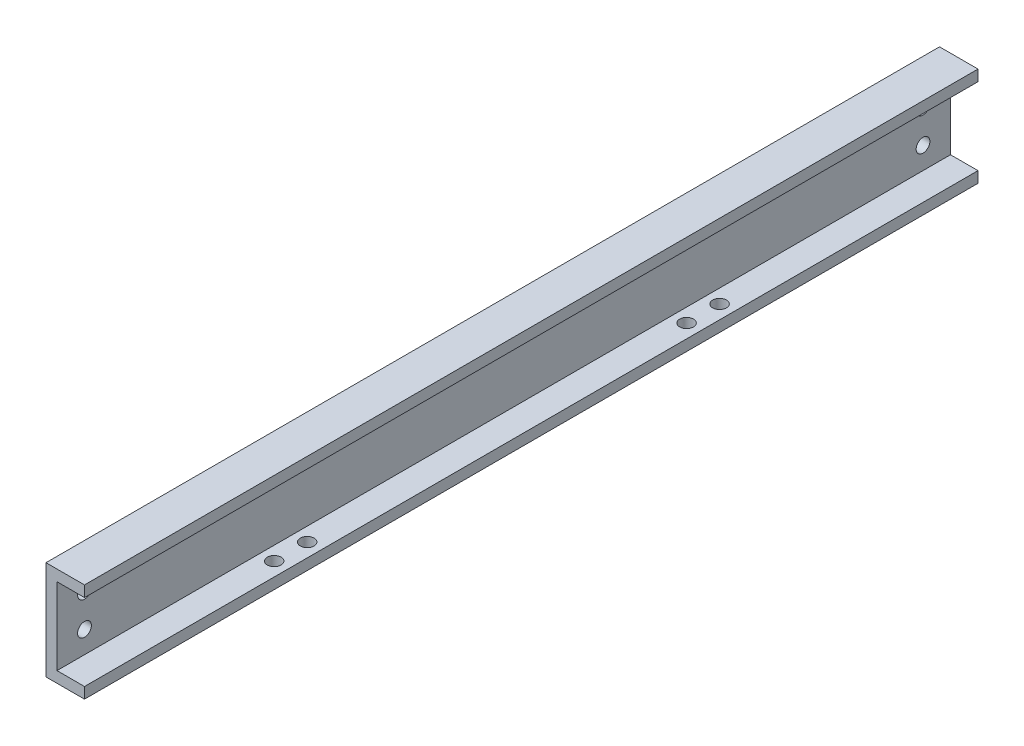
ISO-10303-21;
HEADER;
FILE_DESCRIPTION(('STEP AP214'),'2;1');
FILE_NAME('part.step','',(''),(''),'','','');
FILE_SCHEMA(('AUTOMOTIVE_DESIGN { 1 0 10303 214 1 1 1 1 }'));
ENDSEC;
DATA;
#1=APPLICATION_CONTEXT('core data for automotive mechanical design processes');
#2=APPLICATION_PROTOCOL_DEFINITION('international standard','automotive_design',2000,#1);
#3=PRODUCT_CONTEXT('',#1,'mechanical');
#4=PRODUCT('Part','Part','',(#3));
#5=PRODUCT_RELATED_PRODUCT_CATEGORY('part','',(#4));
#6=PRODUCT_DEFINITION_FORMATION('','',#4);
#7=PRODUCT_DEFINITION_CONTEXT('part definition',#1,'design');
#8=PRODUCT_DEFINITION('design','',#6,#7);
#9=PRODUCT_DEFINITION_SHAPE('','',#8);
#10=(LENGTH_UNIT() NAMED_UNIT(*) SI_UNIT(.MILLI.,.METRE.));
#11=(NAMED_UNIT(*) PLANE_ANGLE_UNIT() SI_UNIT($,.RADIAN.));
#12=(NAMED_UNIT(*) SI_UNIT($,.STERADIAN.) SOLID_ANGLE_UNIT());
#13=UNCERTAINTY_MEASURE_WITH_UNIT(LENGTH_MEASURE(1.E-05),#10,'distance_accuracy_value','');
#14=(GEOMETRIC_REPRESENTATION_CONTEXT(3) GLOBAL_UNCERTAINTY_ASSIGNED_CONTEXT((#13)) GLOBAL_UNIT_ASSIGNED_CONTEXT((#10,
#11,#12)) REPRESENTATION_CONTEXT('',''));
#15=CARTESIAN_POINT('',(0.,0.,0.));
#16=DIRECTION('',(0.,0.,1.));
#17=DIRECTION('',(1.,0.,0.));
#18=AXIS2_PLACEMENT_3D('',#15,#16,#17);
#19=CARTESIAN_POINT('',(0.,9.,-162.5));
#20=DIRECTION('',(-1.,0.,0.));
#21=DIRECTION('',(0.,-1.,0.));
#22=AXIS2_PLACEMENT_3D('',#19,#20,#21);
#23=PLANE('',#22);
#24=CARTESIAN_POINT('',(0.,2.99999999999998,-157.5));
#25=DIRECTION('',(-1.,0.,0.));
#26=DIRECTION('',(0.,1.,0.));
#27=AXIS2_PLACEMENT_3D('',#24,#25,#26);
#28=CIRCLE('',#27,1.25000000000001);
#29=CARTESIAN_POINT('',(0.,4.24999999999999,-157.5));
#30=VERTEX_POINT('',#29);
#31=EDGE_CURVE('E261',#30,#30,#28,.T.);
#32=ORIENTED_EDGE('',*,*,#31,.F.);
#33=EDGE_LOOP('',(#32));
#34=FACE_BOUND('',#33,.T.);
#35=CARTESIAN_POINT('',(0.,-3.00000000000002,-157.5));
#36=DIRECTION('',(-1.,0.,0.));
#37=DIRECTION('',(0.,-1.,0.));
#38=AXIS2_PLACEMENT_3D('',#35,#36,#37);
#39=CIRCLE('',#38,1.25000000000001);
#40=CARTESIAN_POINT('',(0.,-4.25000000000003,-157.5));
#41=VERTEX_POINT('',#40);
#42=EDGE_CURVE('E262',#41,#41,#39,.T.);
#43=ORIENTED_EDGE('',*,*,#42,.F.);
#44=EDGE_LOOP('',(#43));
#45=FACE_BOUND('',#44,.T.);
#46=CARTESIAN_POINT('',(0.,-3.,-5.));
#47=DIRECTION('',(-1.,0.,0.));
#48=DIRECTION('',(0.,1.,0.));
#49=AXIS2_PLACEMENT_3D('',#46,#47,#48);
#50=CIRCLE('',#49,1.25);
#51=CARTESIAN_POINT('',(0.,-1.75,-5.));
#52=VERTEX_POINT('',#51);
#53=EDGE_CURVE('E235',#52,#52,#50,.T.);
#54=ORIENTED_EDGE('',*,*,#53,.F.);
#55=EDGE_LOOP('',(#54));
#56=FACE_BOUND('',#55,.T.);
#57=CARTESIAN_POINT('',(0.,3.,-5.));
#58=DIRECTION('',(-1.,0.,0.));
#59=DIRECTION('',(0.,-1.,0.));
#60=AXIS2_PLACEMENT_3D('',#57,#58,#59);
#61=CIRCLE('',#60,1.25);
#62=CARTESIAN_POINT('',(0.,1.75,-5.));
#63=VERTEX_POINT('',#62);
#64=EDGE_CURVE('E231',#63,#63,#61,.T.);
#65=ORIENTED_EDGE('',*,*,#64,.F.);
#66=EDGE_LOOP('',(#65));
#67=FACE_BOUND('',#66,.T.);
#68=DIRECTION('',(0.,-1.,0.));
#69=VECTOR('',#68,1.);
#70=CARTESIAN_POINT('',(0.,9.,0.));
#71=LINE('',#70,#69);
#72=CARTESIAN_POINT('',(0.,9.,0.));
#73=VERTEX_POINT('',#72);
#74=CARTESIAN_POINT('',(0.,-9.,0.));
#75=VERTEX_POINT('',#74);
#76=EDGE_CURVE('E151',#73,#75,#71,.T.);
#77=ORIENTED_EDGE('',*,*,#76,.F.);
#78=DIRECTION('',(0.,0.,1.));
#79=VECTOR('',#78,1.);
#80=CARTESIAN_POINT('',(0.,9.,-162.5));
#81=LINE('',#80,#79);
#82=CARTESIAN_POINT('',(0.,9.,-162.5));
#83=VERTEX_POINT('',#82);
#84=EDGE_CURVE('E41',#83,#73,#81,.T.);
#85=ORIENTED_EDGE('',*,*,#84,.F.);
#86=DIRECTION('',(0.,-1.,0.));
#87=VECTOR('',#86,1.);
#88=CARTESIAN_POINT('',(0.,9.,-162.5));
#89=LINE('',#88,#87);
#90=CARTESIAN_POINT('',(0.,-9.,-162.5));
#91=VERTEX_POINT('',#90);
#92=EDGE_CURVE('E242',#83,#91,#89,.T.);
#93=ORIENTED_EDGE('',*,*,#92,.T.);
#94=DIRECTION('',(0.,0.,1.));
#95=VECTOR('',#94,1.);
#96=CARTESIAN_POINT('',(0.,-9.,-162.5));
#97=LINE('',#96,#95);
#98=EDGE_CURVE('E176',#91,#75,#97,.T.);
#99=ORIENTED_EDGE('',*,*,#98,.T.);
#100=EDGE_LOOP('',(#77,#85,#93,#99));
#101=FACE_BOUND('',#100,.T.);
#102=DIRECTION('',(0.,0.,-1.));
#103=VECTOR('',#102,1.);
#104=CARTESIAN_POINT('',(0.,1.07514622735803,-8.53208767553185));
#105=LINE('',#104,#103);
#106=CARTESIAN_POINT('',(0.,1.07514622735803,-8.53208767553185));
#107=VERTEX_POINT('',#106);
#108=CARTESIAN_POINT('',(0.,1.07514622735803,-8.84619023963443));
#109=VERTEX_POINT('',#108);
#110=EDGE_CURVE('E297',#107,#109,#105,.T.);
#111=ORIENTED_EDGE('',*,*,#110,.T.);
#112=DIRECTION('',(0.,1.,0.));
#113=VECTOR('',#112,1.);
#114=CARTESIAN_POINT('',(0.,1.07514622735803,-8.84619023963442));
#115=LINE('',#114,#113);
#116=CARTESIAN_POINT('',(0.,4.57514622735803,-8.84619023963442));
#117=VERTEX_POINT('',#116);
#118=EDGE_CURVE('E54',#109,#117,#115,.T.);
#119=ORIENTED_EDGE('',*,*,#118,.T.);
#120=DIRECTION('',(0.,0.,1.));
#121=VECTOR('',#120,1.);
#122=CARTESIAN_POINT('',(0.,4.57514622735803,-8.84619023963442));
#123=LINE('',#122,#121);
#124=CARTESIAN_POINT('',(0.,4.57514622735803,-7.14106203450621));
#125=VERTEX_POINT('',#124);
#126=EDGE_CURVE('E322',#117,#125,#123,.T.);
#127=ORIENTED_EDGE('',*,*,#126,.T.);
#128=DIRECTION('',(0.,-1.,0.));
#129=VECTOR('',#128,1.);
#130=CARTESIAN_POINT('',(0.,4.57514622735803,-7.14106203450621));
#131=LINE('',#130,#129);
#132=CARTESIAN_POINT('',(0.,4.21617186838367,-7.14106203450621));
#133=VERTEX_POINT('',#132);
#134=EDGE_CURVE('E319',#125,#133,#131,.T.);
#135=ORIENTED_EDGE('',*,*,#134,.T.);
#136=DIRECTION('',(0.,0.,-1.));
#137=VECTOR('',#136,1.);
#138=CARTESIAN_POINT('',(0.,4.21617186838367,-7.14106203450621));
#139=LINE('',#138,#137);
#140=CARTESIAN_POINT('',(0.,4.21617186838367,-8.53208767553185));
#141=VERTEX_POINT('',#140);
#142=EDGE_CURVE('E316',#133,#141,#139,.T.);
#143=ORIENTED_EDGE('',*,*,#142,.T.);
#144=DIRECTION('',(0.,-1.,0.));
#145=VECTOR('',#144,1.);
#146=CARTESIAN_POINT('',(0.,4.21617186838367,-8.53208767553185));
#147=LINE('',#146,#145);
#148=CARTESIAN_POINT('',(0.,3.13924879146059,-8.53208767553185));
#149=VERTEX_POINT('',#148);
#150=EDGE_CURVE('E313',#141,#149,#147,.T.);
#151=ORIENTED_EDGE('',*,*,#150,.T.);
#152=DIRECTION('',(0.,0.,1.));
#153=VECTOR('',#152,1.);
#154=CARTESIAN_POINT('',(0.,3.13924879146059,-8.53208767553185));
#155=LINE('',#154,#153);
#156=CARTESIAN_POINT('',(0.,3.13924879146059,-7.14106203450621));
#157=VERTEX_POINT('',#156);
#158=EDGE_CURVE('E310',#149,#157,#155,.T.);
#159=ORIENTED_EDGE('',*,*,#158,.T.);
#160=DIRECTION('',(0.,-1.,0.));
#161=VECTOR('',#160,1.);
#162=CARTESIAN_POINT('',(0.,3.13924879146059,-7.14106203450621));
#163=LINE('',#162,#161);
#164=CARTESIAN_POINT('',(0.,2.78027443248623,-7.14106203450621));
#165=VERTEX_POINT('',#164);
#166=EDGE_CURVE('E307',#157,#165,#163,.T.);
#167=ORIENTED_EDGE('',*,*,#166,.T.);
#168=DIRECTION('',(0.,0.,-1.));
#169=VECTOR('',#168,1.);
#170=CARTESIAN_POINT('',(0.,2.78027443248623,-7.14106203450621));
#171=LINE('',#170,#169);
#172=CARTESIAN_POINT('',(0.,2.78027443248623,-8.53208767553185));
#173=VERTEX_POINT('',#172);
#174=EDGE_CURVE('E304',#165,#173,#171,.T.);
#175=ORIENTED_EDGE('',*,*,#174,.T.);
#176=DIRECTION('',(0.,-1.,0.));
#177=VECTOR('',#176,1.);
#178=CARTESIAN_POINT('',(0.,2.78027443248623,-8.53208767553185));
#179=LINE('',#178,#177);
#180=EDGE_CURVE('E301',#173,#107,#179,.T.);
#181=ORIENTED_EDGE('',*,*,#180,.T.);
#182=EDGE_LOOP('',(#111,#119,#127,#135,#143,#151,#159,#167,#175,#181));
#183=FACE_BOUND('',#182,.T.);
#184=ADVANCED_FACE('F37',(#34,#45,#56,#67,#101,#183),#23,.T.);
#185=CARTESIAN_POINT('',(0.,9.,-162.5));
#186=DIRECTION('',(0.,1.,0.));
#187=DIRECTION('',(0.,0.,1.));
#188=AXIS2_PLACEMENT_3D('',#185,#186,#187);
#189=PLANE('',#188);
#190=DIRECTION('',(-1.,0.,0.));
#191=VECTOR('',#190,1.);
#192=CARTESIAN_POINT('',(0.,9.,0.));
#193=LINE('',#192,#191);
#194=CARTESIAN_POINT('',(7.,9.,0.));
#195=VERTEX_POINT('',#194);
#196=EDGE_CURVE('E148',#195,#73,#193,.T.);
#197=ORIENTED_EDGE('',*,*,#196,.F.);
#198=DIRECTION('',(0.,0.,1.));
#199=VECTOR('',#198,1.);
#200=CARTESIAN_POINT('',(7.,9.,-162.5));
#201=LINE('',#200,#199);
#202=CARTESIAN_POINT('',(7.,9.,-162.5));
#203=VERTEX_POINT('',#202);
#204=EDGE_CURVE('E11',#203,#195,#201,.T.);
#205=ORIENTED_EDGE('',*,*,#204,.F.);
#206=DIRECTION('',(-1.,0.,0.));
#207=VECTOR('',#206,1.);
#208=CARTESIAN_POINT('',(0.,9.,-162.5));
#209=LINE('',#208,#207);
#210=EDGE_CURVE('E169',#203,#83,#209,.T.);
#211=ORIENTED_EDGE('',*,*,#210,.T.);
#212=ORIENTED_EDGE('',*,*,#84,.T.);
#213=EDGE_LOOP('',(#197,#205,#211,#212));
#214=FACE_BOUND('',#213,.T.);
#215=ADVANCED_FACE('F39',(#214),#189,.T.);
#216=CARTESIAN_POINT('',(7.,9.,-162.5));
#217=DIRECTION('',(1.,0.,0.));
#218=DIRECTION('',(0.,0.,-1.));
#219=AXIS2_PLACEMENT_3D('',#216,#217,#218);
#220=PLANE('',#219);
#221=DIRECTION('',(0.,1.,0.));
#222=VECTOR('',#221,1.);
#223=CARTESIAN_POINT('',(7.,9.,0.));
#224=LINE('',#223,#222);
#225=CARTESIAN_POINT('',(7.,7.,0.));
#226=VERTEX_POINT('',#225);
#227=EDGE_CURVE('E167',#226,#195,#224,.T.);
#228=ORIENTED_EDGE('',*,*,#227,.F.);
#229=DIRECTION('',(0.,0.,1.));
#230=VECTOR('',#229,1.);
#231=CARTESIAN_POINT('',(7.,7.,-162.5));
#232=LINE('',#231,#230);
#233=CARTESIAN_POINT('',(7.,7.,-162.5));
#234=VERTEX_POINT('',#233);
#235=EDGE_CURVE('E46',#234,#226,#232,.T.);
#236=ORIENTED_EDGE('',*,*,#235,.F.);
#237=DIRECTION('',(0.,1.,0.));
#238=VECTOR('',#237,1.);
#239=CARTESIAN_POINT('',(7.,9.,-162.5));
#240=LINE('',#239,#238);
#241=EDGE_CURVE('E138',#234,#203,#240,.T.);
#242=ORIENTED_EDGE('',*,*,#241,.T.);
#243=ORIENTED_EDGE('',*,*,#204,.T.);
#244=EDGE_LOOP('',(#228,#236,#242,#243));
#245=FACE_BOUND('',#244,.T.);
#246=ADVANCED_FACE('F181',(#245),#220,.T.);
#247=CARTESIAN_POINT('',(2.,7.,-162.5));
#248=DIRECTION('',(0.,-1.,0.));
#249=DIRECTION('',(0.,0.,-1.));
#250=AXIS2_PLACEMENT_3D('',#247,#248,#249);
#251=PLANE('',#250);
#252=DIRECTION('',(1.,0.,0.));
#253=VECTOR('',#252,1.);
#254=CARTESIAN_POINT('',(2.,7.,0.));
#255=LINE('',#254,#253);
#256=CARTESIAN_POINT('',(2.,7.,0.));
#257=VERTEX_POINT('',#256);
#258=EDGE_CURVE('E125',#257,#226,#255,.T.);
#259=ORIENTED_EDGE('',*,*,#258,.F.);
#260=DIRECTION('',(0.,0.,1.));
#261=VECTOR('',#260,1.);
#262=CARTESIAN_POINT('',(2.,7.,-162.5));
#263=LINE('',#262,#261);
#264=CARTESIAN_POINT('',(2.,7.,-162.5));
#265=VERTEX_POINT('',#264);
#266=EDGE_CURVE('E119',#265,#257,#263,.T.);
#267=ORIENTED_EDGE('',*,*,#266,.F.);
#268=DIRECTION('',(1.,0.,0.));
#269=VECTOR('',#268,1.);
#270=CARTESIAN_POINT('',(2.,7.,-162.5));
#271=LINE('',#270,#269);
#272=EDGE_CURVE('E122',#265,#234,#271,.T.);
#273=ORIENTED_EDGE('',*,*,#272,.T.);
#274=ORIENTED_EDGE('',*,*,#235,.T.);
#275=EDGE_LOOP('',(#259,#267,#273,#274));
#276=FACE_BOUND('',#275,.T.);
#277=ADVANCED_FACE('F121',(#276),#251,.T.);
#278=CARTESIAN_POINT('',(2.,7.,-162.5));
#279=DIRECTION('',(1.,0.,0.));
#280=DIRECTION('',(0.,0.,-1.));
#281=AXIS2_PLACEMENT_3D('',#278,#279,#280);
#282=PLANE('',#281);
#283=CARTESIAN_POINT('',(2.,2.99999999999998,-157.5));
#284=DIRECTION('',(1.,0.,0.));
#285=DIRECTION('',(0.,0.,-1.));
#286=AXIS2_PLACEMENT_3D('',#283,#284,#285);
#287=CIRCLE('',#286,1.25000000000001);
#288=CARTESIAN_POINT('',(2.,2.99999999999998,-158.75));
#289=VERTEX_POINT('',#288);
#290=EDGE_CURVE('E152',#289,#289,#287,.T.);
#291=ORIENTED_EDGE('',*,*,#290,.F.);
#292=EDGE_LOOP('',(#291));
#293=FACE_BOUND('',#292,.T.);
#294=CARTESIAN_POINT('',(2.,-3.00000000000002,-157.5));
#295=DIRECTION('',(1.,0.,0.));
#296=DIRECTION('',(0.,0.,-1.));
#297=AXIS2_PLACEMENT_3D('',#294,#295,#296);
#298=CIRCLE('',#297,1.25000000000001);
#299=CARTESIAN_POINT('',(2.,-3.00000000000002,-158.75));
#300=VERTEX_POINT('',#299);
#301=EDGE_CURVE('E222',#300,#300,#298,.T.);
#302=ORIENTED_EDGE('',*,*,#301,.F.);
#303=EDGE_LOOP('',(#302));
#304=FACE_BOUND('',#303,.T.);
#305=CARTESIAN_POINT('',(2.,-3.,-5.));
#306=DIRECTION('',(1.,0.,0.));
#307=DIRECTION('',(0.,0.,-1.));
#308=AXIS2_PLACEMENT_3D('',#305,#306,#307);
#309=CIRCLE('',#308,1.25);
#310=CARTESIAN_POINT('',(2.,-3.,-6.25));
#311=VERTEX_POINT('',#310);
#312=EDGE_CURVE('E226',#311,#311,#309,.T.);
#313=ORIENTED_EDGE('',*,*,#312,.F.);
#314=EDGE_LOOP('',(#313));
#315=FACE_BOUND('',#314,.T.);
#316=CARTESIAN_POINT('',(2.,3.,-5.));
#317=DIRECTION('',(1.,0.,0.));
#318=DIRECTION('',(0.,0.,-1.));
#319=AXIS2_PLACEMENT_3D('',#316,#317,#318);
#320=CIRCLE('',#319,1.25);
#321=CARTESIAN_POINT('',(2.,3.,-6.25));
#322=VERTEX_POINT('',#321);
#323=EDGE_CURVE('E229',#322,#322,#320,.T.);
#324=ORIENTED_EDGE('',*,*,#323,.F.);
#325=EDGE_LOOP('',(#324));
#326=FACE_BOUND('',#325,.T.);
#327=DIRECTION('',(0.,1.,0.));
#328=VECTOR('',#327,1.);
#329=CARTESIAN_POINT('',(2.,7.,0.));
#330=LINE('',#329,#328);
#331=CARTESIAN_POINT('',(2.,-7.,0.));
#332=VERTEX_POINT('',#331);
#333=EDGE_CURVE('E164',#332,#257,#330,.T.);
#334=ORIENTED_EDGE('',*,*,#333,.F.);
#335=DIRECTION('',(0.,0.,1.));
#336=VECTOR('',#335,1.);
#337=CARTESIAN_POINT('',(2.,-7.,-162.5));
#338=LINE('',#337,#336);
#339=CARTESIAN_POINT('',(2.,-7.,-162.5));
#340=VERTEX_POINT('',#339);
#341=EDGE_CURVE('E130',#340,#332,#338,.T.);
#342=ORIENTED_EDGE('',*,*,#341,.F.);
#343=DIRECTION('',(0.,1.,0.));
#344=VECTOR('',#343,1.);
#345=CARTESIAN_POINT('',(2.,7.,-162.5));
#346=LINE('',#345,#344);
#347=EDGE_CURVE('E136',#340,#265,#346,.T.);
#348=ORIENTED_EDGE('',*,*,#347,.T.);
#349=ORIENTED_EDGE('',*,*,#266,.T.);
#350=EDGE_LOOP('',(#334,#342,#348,#349));
#351=FACE_BOUND('',#350,.T.);
#352=ADVANCED_FACE('F140',(#293,#304,#315,#326,#351),#282,.T.);
#353=CARTESIAN_POINT('',(2.,-7.,-162.5));
#354=DIRECTION('',(0.,1.,0.));
#355=DIRECTION('',(-1.,0.,0.));
#356=AXIS2_PLACEMENT_3D('',#353,#354,#355);
#357=PLANE('',#356);
#358=CARTESIAN_POINT('',(4.50000000000001,-7.,-37.));
#359=DIRECTION('',(0.,1.,0.));
#360=DIRECTION('',(-1.,0.,0.));
#361=AXIS2_PLACEMENT_3D('',#358,#359,#360);
#362=CIRCLE('',#361,1.25);
#363=CARTESIAN_POINT('',(3.25000000000001,-7.,-37.));
#364=VERTEX_POINT('',#363);
#365=EDGE_CURVE('E326',#364,#364,#362,.T.);
#366=ORIENTED_EDGE('',*,*,#365,.F.);
#367=EDGE_LOOP('',(#366));
#368=FACE_BOUND('',#367,.T.);
#369=CARTESIAN_POINT('',(4.5,-7.,-43.));
#370=DIRECTION('',(0.,1.,0.));
#371=DIRECTION('',(-1.,0.,0.));
#372=AXIS2_PLACEMENT_3D('',#369,#370,#371);
#373=CIRCLE('',#372,1.25);
#374=CARTESIAN_POINT('',(3.25,-7.,-43.));
#375=VERTEX_POINT('',#374);
#376=EDGE_CURVE('E357',#375,#375,#373,.T.);
#377=ORIENTED_EDGE('',*,*,#376,.F.);
#378=EDGE_LOOP('',(#377));
#379=FACE_BOUND('',#378,.T.);
#380=CARTESIAN_POINT('',(4.50000000000002,-7.,-112.));
#381=DIRECTION('',(0.,1.,0.));
#382=DIRECTION('',(-1.,0.,0.));
#383=AXIS2_PLACEMENT_3D('',#380,#381,#382);
#384=CIRCLE('',#383,1.25);
#385=CARTESIAN_POINT('',(3.25000000000002,-7.,-112.));
#386=VERTEX_POINT('',#385);
#387=EDGE_CURVE('E360',#386,#386,#384,.T.);
#388=ORIENTED_EDGE('',*,*,#387,.F.);
#389=EDGE_LOOP('',(#388));
#390=FACE_BOUND('',#389,.T.);
#391=CARTESIAN_POINT('',(4.50000000000002,-7.,-118.));
#392=DIRECTION('',(0.,1.,0.));
#393=DIRECTION('',(-1.,0.,0.));
#394=AXIS2_PLACEMENT_3D('',#391,#392,#393);
#395=CIRCLE('',#394,1.25);
#396=CARTESIAN_POINT('',(3.25000000000002,-7.,-118.));
#397=VERTEX_POINT('',#396);
#398=EDGE_CURVE('E363',#397,#397,#395,.T.);
#399=ORIENTED_EDGE('',*,*,#398,.F.);
#400=EDGE_LOOP('',(#399));
#401=FACE_BOUND('',#400,.T.);
#402=DIRECTION('',(-1.,0.,0.));
#403=VECTOR('',#402,1.);
#404=CARTESIAN_POINT('',(2.,-7.,0.));
#405=LINE('',#404,#403);
#406=CARTESIAN_POINT('',(7.,-7.,0.));
#407=VERTEX_POINT('',#406);
#408=EDGE_CURVE('E161',#407,#332,#405,.T.);
#409=ORIENTED_EDGE('',*,*,#408,.F.);
#410=DIRECTION('',(0.,0.,1.));
#411=VECTOR('',#410,1.);
#412=CARTESIAN_POINT('',(7.,-7.,-162.5));
#413=LINE('',#412,#411);
#414=CARTESIAN_POINT('',(7.,-7.,-162.5));
#415=VERTEX_POINT('',#414);
#416=EDGE_CURVE('E173',#415,#407,#413,.T.);
#417=ORIENTED_EDGE('',*,*,#416,.F.);
#418=DIRECTION('',(-1.,0.,0.));
#419=VECTOR('',#418,1.);
#420=CARTESIAN_POINT('',(2.,-7.,-162.5));
#421=LINE('',#420,#419);
#422=EDGE_CURVE('E141',#415,#340,#421,.T.);
#423=ORIENTED_EDGE('',*,*,#422,.T.);
#424=ORIENTED_EDGE('',*,*,#341,.T.);
#425=EDGE_LOOP('',(#409,#417,#423,#424));
#426=FACE_BOUND('',#425,.T.);
#427=ADVANCED_FACE('F206',(#368,#379,#390,#401,#426),#357,.T.);
#428=CARTESIAN_POINT('',(7.,-9.,-162.5));
#429=DIRECTION('',(1.,0.,0.));
#430=DIRECTION('',(0.,0.,-1.));
#431=AXIS2_PLACEMENT_3D('',#428,#429,#430);
#432=PLANE('',#431);
#433=DIRECTION('',(0.,1.,0.));
#434=VECTOR('',#433,1.);
#435=CARTESIAN_POINT('',(7.,-9.,0.));
#436=LINE('',#435,#434);
#437=CARTESIAN_POINT('',(7.,-9.,0.));
#438=VERTEX_POINT('',#437);
#439=EDGE_CURVE('E158',#438,#407,#436,.T.);
#440=ORIENTED_EDGE('',*,*,#439,.F.);
#441=DIRECTION('',(0.,0.,1.));
#442=VECTOR('',#441,1.);
#443=CARTESIAN_POINT('',(7.,-9.,-162.5));
#444=LINE('',#443,#442);
#445=CARTESIAN_POINT('',(7.,-9.,-162.5));
#446=VERTEX_POINT('',#445);
#447=EDGE_CURVE('E175',#446,#438,#444,.T.);
#448=ORIENTED_EDGE('',*,*,#447,.F.);
#449=DIRECTION('',(0.,1.,0.));
#450=VECTOR('',#449,1.);
#451=CARTESIAN_POINT('',(7.,-9.,-162.5));
#452=LINE('',#451,#450);
#453=EDGE_CURVE('E143',#446,#415,#452,.T.);
#454=ORIENTED_EDGE('',*,*,#453,.T.);
#455=ORIENTED_EDGE('',*,*,#416,.T.);
#456=EDGE_LOOP('',(#440,#448,#454,#455));
#457=FACE_BOUND('',#456,.T.);
#458=ADVANCED_FACE('F202',(#457),#432,.T.);
#459=CARTESIAN_POINT('',(0.,-9.,-162.5));
#460=DIRECTION('',(0.,-1.,0.));
#461=DIRECTION('',(0.,0.,-1.));
#462=AXIS2_PLACEMENT_3D('',#459,#460,#461);
#463=PLANE('',#462);
#464=CARTESIAN_POINT('',(4.50000000000001,-9.,-37.));
#465=DIRECTION('',(0.,-1.,0.));
#466=DIRECTION('',(0.,0.,-1.));
#467=AXIS2_PLACEMENT_3D('',#464,#465,#466);
#468=CIRCLE('',#467,1.25);
#469=CARTESIAN_POINT('',(4.50000000000001,-9.,-38.25));
#470=VERTEX_POINT('',#469);
#471=EDGE_CURVE('E366',#470,#470,#468,.T.);
#472=ORIENTED_EDGE('',*,*,#471,.F.);
#473=EDGE_LOOP('',(#472));
#474=FACE_BOUND('',#473,.T.);
#475=CARTESIAN_POINT('',(4.5,-9.,-43.));
#476=DIRECTION('',(0.,-1.,0.));
#477=DIRECTION('',(0.,0.,1.));
#478=AXIS2_PLACEMENT_3D('',#475,#476,#477);
#479=CIRCLE('',#478,1.25);
#480=CARTESIAN_POINT('',(4.5,-9.,-41.75));
#481=VERTEX_POINT('',#480);
#482=EDGE_CURVE('E373',#481,#481,#479,.T.);
#483=ORIENTED_EDGE('',*,*,#482,.F.);
#484=EDGE_LOOP('',(#483));
#485=FACE_BOUND('',#484,.T.);
#486=CARTESIAN_POINT('',(4.50000000000002,-9.,-112.));
#487=DIRECTION('',(0.,-1.,0.));
#488=DIRECTION('',(0.,0.,-1.));
#489=AXIS2_PLACEMENT_3D('',#486,#487,#488);
#490=CIRCLE('',#489,1.25);
#491=CARTESIAN_POINT('',(4.50000000000002,-9.,-113.25));
#492=VERTEX_POINT('',#491);
#493=EDGE_CURVE('E370',#492,#492,#490,.T.);
#494=ORIENTED_EDGE('',*,*,#493,.F.);
#495=EDGE_LOOP('',(#494));
#496=FACE_BOUND('',#495,.T.);
#497=CARTESIAN_POINT('',(4.50000000000002,-9.,-118.));
#498=DIRECTION('',(0.,-1.,0.));
#499=DIRECTION('',(0.,0.,1.));
#500=AXIS2_PLACEMENT_3D('',#497,#498,#499);
#501=CIRCLE('',#500,1.25);
#502=CARTESIAN_POINT('',(4.50000000000002,-9.,-116.75));
#503=VERTEX_POINT('',#502);
#504=EDGE_CURVE('E367',#503,#503,#501,.T.);
#505=ORIENTED_EDGE('',*,*,#504,.F.);
#506=EDGE_LOOP('',(#505));
#507=FACE_BOUND('',#506,.T.);
#508=DIRECTION('',(1.,0.,0.));
#509=VECTOR('',#508,1.);
#510=CARTESIAN_POINT('',(0.,-9.,0.));
#511=LINE('',#510,#509);
#512=EDGE_CURVE('E155',#75,#438,#511,.T.);
#513=ORIENTED_EDGE('',*,*,#512,.F.);
#514=ORIENTED_EDGE('',*,*,#98,.F.);
#515=DIRECTION('',(1.,0.,0.));
#516=VECTOR('',#515,1.);
#517=CARTESIAN_POINT('',(0.,-9.,-162.5));
#518=LINE('',#517,#516);
#519=EDGE_CURVE('E244',#91,#446,#518,.T.);
#520=ORIENTED_EDGE('',*,*,#519,.T.);
#521=ORIENTED_EDGE('',*,*,#447,.T.);
#522=EDGE_LOOP('',(#513,#514,#520,#521));
#523=FACE_BOUND('',#522,.T.);
#524=ADVANCED_FACE('F199',(#474,#485,#496,#507,#523),#463,.T.);
#525=CARTESIAN_POINT('',(0.,0.,-162.5));
#526=DIRECTION('',(0.,0.,-1.));
#527=DIRECTION('',(-1.,0.,0.));
#528=AXIS2_PLACEMENT_3D('',#525,#526,#527);
#529=PLANE('',#528);
#530=ORIENTED_EDGE('',*,*,#210,.F.);
#531=ORIENTED_EDGE('',*,*,#241,.F.);
#532=ORIENTED_EDGE('',*,*,#272,.F.);
#533=ORIENTED_EDGE('',*,*,#347,.F.);
#534=ORIENTED_EDGE('',*,*,#422,.F.);
#535=ORIENTED_EDGE('',*,*,#453,.F.);
#536=ORIENTED_EDGE('',*,*,#519,.F.);
#537=ORIENTED_EDGE('',*,*,#92,.F.);
#538=EDGE_LOOP('',(#530,#531,#532,#533,#534,#535,#536,#537));
#539=FACE_BOUND('',#538,.T.);
#540=ADVANCED_FACE('F134',(#539),#529,.T.);
#541=CARTESIAN_POINT('',(0.,0.,0.));
#542=DIRECTION('',(0.,0.,-1.));
#543=DIRECTION('',(-1.,0.,0.));
#544=AXIS2_PLACEMENT_3D('',#541,#542,#543);
#545=PLANE('',#544);
#546=ORIENTED_EDGE('',*,*,#196,.T.);
#547=ORIENTED_EDGE('',*,*,#76,.T.);
#548=ORIENTED_EDGE('',*,*,#512,.T.);
#549=ORIENTED_EDGE('',*,*,#439,.T.);
#550=ORIENTED_EDGE('',*,*,#408,.T.);
#551=ORIENTED_EDGE('',*,*,#333,.T.);
#552=ORIENTED_EDGE('',*,*,#258,.T.);
#553=ORIENTED_EDGE('',*,*,#227,.T.);
#554=EDGE_LOOP('',(#546,#547,#548,#549,#550,#551,#552,#553));
#555=FACE_BOUND('',#554,.T.);
#556=ADVANCED_FACE('F180',(#555),#545,.F.);
#557=CARTESIAN_POINT('',(7.,3.,-5.));
#558=DIRECTION('',(-1.,0.,0.));
#559=DIRECTION('',(0.,-1.,0.));
#560=AXIS2_PLACEMENT_3D('',#557,#558,#559);
#561=CYLINDRICAL_SURFACE('',#560,1.25);
#562=ORIENTED_EDGE('',*,*,#323,.T.);
#563=EDGE_LOOP('',(#562));
#564=FACE_BOUND('',#563,.T.);
#565=ORIENTED_EDGE('',*,*,#64,.T.);
#566=EDGE_LOOP('',(#565));
#567=FACE_BOUND('',#566,.T.);
#568=ADVANCED_FACE('F445',(#564,#567),#561,.F.);
#569=CARTESIAN_POINT('',(7.,-3.,-5.));
#570=DIRECTION('',(-1.,0.,0.));
#571=DIRECTION('',(0.,-1.,0.));
#572=AXIS2_PLACEMENT_3D('',#569,#570,#571);
#573=CYLINDRICAL_SURFACE('',#572,1.25);
#574=ORIENTED_EDGE('',*,*,#312,.T.);
#575=EDGE_LOOP('',(#574));
#576=FACE_BOUND('',#575,.T.);
#577=ORIENTED_EDGE('',*,*,#53,.T.);
#578=EDGE_LOOP('',(#577));
#579=FACE_BOUND('',#578,.T.);
#580=ADVANCED_FACE('F442',(#576,#579),#573,.F.);
#581=CARTESIAN_POINT('',(7.,-3.00000000000002,-157.5));
#582=DIRECTION('',(-1.,0.,0.));
#583=DIRECTION('',(0.,-1.,0.));
#584=AXIS2_PLACEMENT_3D('',#581,#582,#583);
#585=CYLINDRICAL_SURFACE('',#584,1.25000000000001);
#586=ORIENTED_EDGE('',*,*,#301,.T.);
#587=EDGE_LOOP('',(#586));
#588=FACE_BOUND('',#587,.T.);
#589=ORIENTED_EDGE('',*,*,#42,.T.);
#590=EDGE_LOOP('',(#589));
#591=FACE_BOUND('',#590,.T.);
#592=ADVANCED_FACE('F258',(#588,#591),#585,.F.);
#593=CARTESIAN_POINT('',(7.,2.99999999999998,-157.5));
#594=DIRECTION('',(-1.,0.,0.));
#595=DIRECTION('',(0.,-1.,0.));
#596=AXIS2_PLACEMENT_3D('',#593,#594,#595);
#597=CYLINDRICAL_SURFACE('',#596,1.25000000000001);
#598=ORIENTED_EDGE('',*,*,#290,.T.);
#599=EDGE_LOOP('',(#598));
#600=FACE_BOUND('',#599,.T.);
#601=ORIENTED_EDGE('',*,*,#31,.T.);
#602=EDGE_LOOP('',(#601));
#603=FACE_BOUND('',#602,.T.);
#604=ADVANCED_FACE('F254',(#600,#603),#597,.F.);
#605=CARTESIAN_POINT('',(1.,1.07514622735803,-8.84619023963442));
#606=DIRECTION('',(0.,0.,1.));
#607=DIRECTION('',(1.,0.,0.));
#608=AXIS2_PLACEMENT_3D('',#605,#606,#607);
#609=PLANE('',#608);
#610=ORIENTED_EDGE('',*,*,#118,.F.);
#611=DIRECTION('',(-1.,0.,0.));
#612=VECTOR('',#611,1.);
#613=CARTESIAN_POINT('',(1.,1.07514622735803,-8.84619023963442));
#614=LINE('',#613,#612);
#615=CARTESIAN_POINT('',(1.,1.07514622735803,-8.84619023963442));
#616=VERTEX_POINT('',#615);
#617=EDGE_CURVE('E294',#616,#109,#614,.T.);
#618=ORIENTED_EDGE('',*,*,#617,.F.);
#619=DIRECTION('',(0.,1.,0.));
#620=VECTOR('',#619,1.);
#621=CARTESIAN_POINT('',(1.,1.07514622735803,-8.84619023963442));
#622=LINE('',#621,#620);
#623=CARTESIAN_POINT('',(0.999999999999999,4.57514622735803,-8.84619023963442));
#624=VERTEX_POINT('',#623);
#625=EDGE_CURVE('E300',#616,#624,#622,.T.);
#626=ORIENTED_EDGE('',*,*,#625,.T.);
#627=DIRECTION('',(-1.,0.,0.));
#628=VECTOR('',#627,1.);
#629=CARTESIAN_POINT('',(0.999999999999999,4.57514622735803,-8.84619023963442));
#630=LINE('',#629,#628);
#631=EDGE_CURVE('E263',#624,#117,#630,.T.);
#632=ORIENTED_EDGE('',*,*,#631,.T.);
#633=EDGE_LOOP('',(#610,#618,#626,#632));
#634=FACE_BOUND('',#633,.T.);
#635=ADVANCED_FACE('F257',(#634),#609,.T.);
#636=CARTESIAN_POINT('',(0.999999999999999,4.57514622735803,-8.84619023963442));
#637=DIRECTION('',(0.,-1.,0.));
#638=DIRECTION('',(1.,0.,0.));
#639=AXIS2_PLACEMENT_3D('',#636,#637,#638);
#640=PLANE('',#639);
#641=ORIENTED_EDGE('',*,*,#126,.F.);
#642=ORIENTED_EDGE('',*,*,#631,.F.);
#643=DIRECTION('',(0.,0.,1.));
#644=VECTOR('',#643,1.);
#645=CARTESIAN_POINT('',(0.999999999999999,4.57514622735803,-8.84619023963442));
#646=LINE('',#645,#644);
#647=CARTESIAN_POINT('',(0.999999999999999,4.57514622735803,-7.14106203450621));
#648=VERTEX_POINT('',#647);
#649=EDGE_CURVE('E350',#624,#648,#646,.T.);
#650=ORIENTED_EDGE('',*,*,#649,.T.);
#651=DIRECTION('',(-1.,0.,0.));
#652=VECTOR('',#651,1.);
#653=CARTESIAN_POINT('',(0.999999999999999,4.57514622735803,-7.14106203450621));
#654=LINE('',#653,#652);
#655=EDGE_CURVE('E266',#648,#125,#654,.T.);
#656=ORIENTED_EDGE('',*,*,#655,.T.);
#657=EDGE_LOOP('',(#641,#642,#650,#656));
#658=FACE_BOUND('',#657,.T.);
#659=ADVANCED_FACE('F435',(#658),#640,.T.);
#660=CARTESIAN_POINT('',(0.999999999999999,4.57514622735803,-7.14106203450621));
#661=DIRECTION('',(0.,0.,-1.));
#662=DIRECTION('',(-1.,0.,0.));
#663=AXIS2_PLACEMENT_3D('',#660,#661,#662);
#664=PLANE('',#663);
#665=ORIENTED_EDGE('',*,*,#134,.F.);
#666=ORIENTED_EDGE('',*,*,#655,.F.);
#667=DIRECTION('',(0.,-1.,0.));
#668=VECTOR('',#667,1.);
#669=CARTESIAN_POINT('',(0.999999999999999,4.57514622735803,-7.14106203450621));
#670=LINE('',#669,#668);
#671=CARTESIAN_POINT('',(1.,4.21617186838367,-7.14106203450621));
#672=VERTEX_POINT('',#671);
#673=EDGE_CURVE('E347',#648,#672,#670,.T.);
#674=ORIENTED_EDGE('',*,*,#673,.T.);
#675=DIRECTION('',(-1.,0.,0.));
#676=VECTOR('',#675,1.);
#677=CARTESIAN_POINT('',(1.,4.21617186838367,-7.14106203450621));
#678=LINE('',#677,#676);
#679=EDGE_CURVE('E273',#672,#133,#678,.T.);
#680=ORIENTED_EDGE('',*,*,#679,.T.);
#681=EDGE_LOOP('',(#665,#666,#674,#680));
#682=FACE_BOUND('',#681,.T.);
#683=ADVANCED_FACE('F431',(#682),#664,.T.);
#684=CARTESIAN_POINT('',(1.,4.21617186838367,-7.14106203450621));
#685=DIRECTION('',(0.,1.,0.));
#686=DIRECTION('',(-1.,0.,0.));
#687=AXIS2_PLACEMENT_3D('',#684,#685,#686);
#688=PLANE('',#687);
#689=ORIENTED_EDGE('',*,*,#142,.F.);
#690=ORIENTED_EDGE('',*,*,#679,.F.);
#691=DIRECTION('',(0.,0.,-1.));
#692=VECTOR('',#691,1.);
#693=CARTESIAN_POINT('',(1.,4.21617186838367,-7.14106203450621));
#694=LINE('',#693,#692);
#695=CARTESIAN_POINT('',(1.,4.21617186838367,-8.53208767553185));
#696=VERTEX_POINT('',#695);
#697=EDGE_CURVE('E344',#672,#696,#694,.T.);
#698=ORIENTED_EDGE('',*,*,#697,.T.);
#699=DIRECTION('',(-1.,0.,0.));
#700=VECTOR('',#699,1.);
#701=CARTESIAN_POINT('',(1.,4.21617186838367,-8.53208767553185));
#702=LINE('',#701,#700);
#703=EDGE_CURVE('E276',#696,#141,#702,.T.);
#704=ORIENTED_EDGE('',*,*,#703,.T.);
#705=EDGE_LOOP('',(#689,#690,#698,#704));
#706=FACE_BOUND('',#705,.T.);
#707=ADVANCED_FACE('F427',(#706),#688,.T.);
#708=CARTESIAN_POINT('',(1.,4.21617186838367,-8.53208767553185));
#709=DIRECTION('',(0.,0.,-1.));
#710=DIRECTION('',(-1.,0.,0.));
#711=AXIS2_PLACEMENT_3D('',#708,#709,#710);
#712=PLANE('',#711);
#713=ORIENTED_EDGE('',*,*,#150,.F.);
#714=ORIENTED_EDGE('',*,*,#703,.F.);
#715=DIRECTION('',(0.,-1.,0.));
#716=VECTOR('',#715,1.);
#717=CARTESIAN_POINT('',(1.,4.21617186838367,-8.53208767553185));
#718=LINE('',#717,#716);
#719=CARTESIAN_POINT('',(1.,3.13924879146059,-8.53208767553185));
#720=VERTEX_POINT('',#719);
#721=EDGE_CURVE('E341',#696,#720,#718,.T.);
#722=ORIENTED_EDGE('',*,*,#721,.T.);
#723=DIRECTION('',(-1.,0.,0.));
#724=VECTOR('',#723,1.);
#725=CARTESIAN_POINT('',(1.,3.13924879146059,-8.53208767553185));
#726=LINE('',#725,#724);
#727=EDGE_CURVE('E279',#720,#149,#726,.T.);
#728=ORIENTED_EDGE('',*,*,#727,.T.);
#729=EDGE_LOOP('',(#713,#714,#722,#728));
#730=FACE_BOUND('',#729,.T.);
#731=ADVANCED_FACE('F423',(#730),#712,.T.);
#732=CARTESIAN_POINT('',(1.,3.13924879146059,-8.53208767553185));
#733=DIRECTION('',(0.,-1.,0.));
#734=DIRECTION('',(1.,0.,0.));
#735=AXIS2_PLACEMENT_3D('',#732,#733,#734);
#736=PLANE('',#735);
#737=ORIENTED_EDGE('',*,*,#158,.F.);
#738=ORIENTED_EDGE('',*,*,#727,.F.);
#739=DIRECTION('',(0.,0.,1.));
#740=VECTOR('',#739,1.);
#741=CARTESIAN_POINT('',(1.,3.13924879146059,-8.53208767553185));
#742=LINE('',#741,#740);
#743=CARTESIAN_POINT('',(1.,3.13924879146059,-7.14106203450621));
#744=VERTEX_POINT('',#743);
#745=EDGE_CURVE('E338',#720,#744,#742,.T.);
#746=ORIENTED_EDGE('',*,*,#745,.T.);
#747=DIRECTION('',(-1.,0.,0.));
#748=VECTOR('',#747,1.);
#749=CARTESIAN_POINT('',(1.,3.13924879146059,-7.14106203450621));
#750=LINE('',#749,#748);
#751=EDGE_CURVE('E282',#744,#157,#750,.T.);
#752=ORIENTED_EDGE('',*,*,#751,.T.);
#753=EDGE_LOOP('',(#737,#738,#746,#752));
#754=FACE_BOUND('',#753,.T.);
#755=ADVANCED_FACE('F419',(#754),#736,.T.);
#756=CARTESIAN_POINT('',(1.,3.13924879146059,-7.14106203450621));
#757=DIRECTION('',(0.,0.,-1.));
#758=DIRECTION('',(-1.,0.,0.));
#759=AXIS2_PLACEMENT_3D('',#756,#757,#758);
#760=PLANE('',#759);
#761=ORIENTED_EDGE('',*,*,#166,.F.);
#762=ORIENTED_EDGE('',*,*,#751,.F.);
#763=DIRECTION('',(0.,-1.,0.));
#764=VECTOR('',#763,1.);
#765=CARTESIAN_POINT('',(1.,3.13924879146059,-7.14106203450621));
#766=LINE('',#765,#764);
#767=CARTESIAN_POINT('',(1.,2.78027443248623,-7.14106203450621));
#768=VERTEX_POINT('',#767);
#769=EDGE_CURVE('E335',#744,#768,#766,.T.);
#770=ORIENTED_EDGE('',*,*,#769,.T.);
#771=DIRECTION('',(-1.,0.,0.));
#772=VECTOR('',#771,1.);
#773=CARTESIAN_POINT('',(1.,2.78027443248623,-7.14106203450621));
#774=LINE('',#773,#772);
#775=EDGE_CURVE('E285',#768,#165,#774,.T.);
#776=ORIENTED_EDGE('',*,*,#775,.T.);
#777=EDGE_LOOP('',(#761,#762,#770,#776));
#778=FACE_BOUND('',#777,.T.);
#779=ADVANCED_FACE('F415',(#778),#760,.T.);
#780=CARTESIAN_POINT('',(1.,2.78027443248623,-7.14106203450621));
#781=DIRECTION('',(0.,1.,0.));
#782=DIRECTION('',(-1.,0.,0.));
#783=AXIS2_PLACEMENT_3D('',#780,#781,#782);
#784=PLANE('',#783);
#785=ORIENTED_EDGE('',*,*,#174,.F.);
#786=ORIENTED_EDGE('',*,*,#775,.F.);
#787=DIRECTION('',(0.,0.,-1.));
#788=VECTOR('',#787,1.);
#789=CARTESIAN_POINT('',(1.,2.78027443248623,-7.14106203450621));
#790=LINE('',#789,#788);
#791=CARTESIAN_POINT('',(1.,2.78027443248623,-8.53208767553185));
#792=VERTEX_POINT('',#791);
#793=EDGE_CURVE('E332',#768,#792,#790,.T.);
#794=ORIENTED_EDGE('',*,*,#793,.T.);
#795=DIRECTION('',(-1.,0.,0.));
#796=VECTOR('',#795,1.);
#797=CARTESIAN_POINT('',(1.,2.78027443248623,-8.53208767553185));
#798=LINE('',#797,#796);
#799=EDGE_CURVE('E288',#792,#173,#798,.T.);
#800=ORIENTED_EDGE('',*,*,#799,.T.);
#801=EDGE_LOOP('',(#785,#786,#794,#800));
#802=FACE_BOUND('',#801,.T.);
#803=ADVANCED_FACE('F411',(#802),#784,.T.);
#804=CARTESIAN_POINT('',(1.,2.78027443248623,-8.53208767553185));
#805=DIRECTION('',(0.,0.,-1.));
#806=DIRECTION('',(-1.,0.,0.));
#807=AXIS2_PLACEMENT_3D('',#804,#805,#806);
#808=PLANE('',#807);
#809=ORIENTED_EDGE('',*,*,#180,.F.);
#810=ORIENTED_EDGE('',*,*,#799,.F.);
#811=DIRECTION('',(0.,-1.,0.));
#812=VECTOR('',#811,1.);
#813=CARTESIAN_POINT('',(1.,2.78027443248623,-8.53208767553185));
#814=LINE('',#813,#812);
#815=CARTESIAN_POINT('',(1.,1.07514622735803,-8.53208767553185));
#816=VERTEX_POINT('',#815);
#817=EDGE_CURVE('E329',#792,#816,#814,.T.);
#818=ORIENTED_EDGE('',*,*,#817,.T.);
#819=DIRECTION('',(-1.,0.,0.));
#820=VECTOR('',#819,1.);
#821=CARTESIAN_POINT('',(1.,1.07514622735803,-8.53208767553185));
#822=LINE('',#821,#820);
#823=EDGE_CURVE('E291',#816,#107,#822,.T.);
#824=ORIENTED_EDGE('',*,*,#823,.T.);
#825=EDGE_LOOP('',(#809,#810,#818,#824));
#826=FACE_BOUND('',#825,.T.);
#827=ADVANCED_FACE('F407',(#826),#808,.T.);
#828=CARTESIAN_POINT('',(1.,1.07514622735803,-8.53208767553185));
#829=DIRECTION('',(0.,1.,0.));
#830=DIRECTION('',(-1.,0.,0.));
#831=AXIS2_PLACEMENT_3D('',#828,#829,#830);
#832=PLANE('',#831);
#833=ORIENTED_EDGE('',*,*,#110,.F.);
#834=ORIENTED_EDGE('',*,*,#823,.F.);
#835=DIRECTION('',(0.,0.,-1.));
#836=VECTOR('',#835,1.);
#837=CARTESIAN_POINT('',(1.,1.07514622735803,-8.53208767553185));
#838=LINE('',#837,#836);
#839=EDGE_CURVE('E296',#816,#616,#838,.T.);
#840=ORIENTED_EDGE('',*,*,#839,.T.);
#841=ORIENTED_EDGE('',*,*,#617,.T.);
#842=EDGE_LOOP('',(#833,#834,#840,#841));
#843=FACE_BOUND('',#842,.T.);
#844=ADVANCED_FACE('F400',(#843),#832,.T.);
#845=CARTESIAN_POINT('',(1.,0.,0.));
#846=DIRECTION('',(1.,0.,0.));
#847=DIRECTION('',(0.,1.,0.));
#848=AXIS2_PLACEMENT_3D('',#845,#846,#847);
#849=PLANE('',#848);
#850=ORIENTED_EDGE('',*,*,#625,.F.);
#851=ORIENTED_EDGE('',*,*,#839,.F.);
#852=ORIENTED_EDGE('',*,*,#817,.F.);
#853=ORIENTED_EDGE('',*,*,#793,.F.);
#854=ORIENTED_EDGE('',*,*,#769,.F.);
#855=ORIENTED_EDGE('',*,*,#745,.F.);
#856=ORIENTED_EDGE('',*,*,#721,.F.);
#857=ORIENTED_EDGE('',*,*,#697,.F.);
#858=ORIENTED_EDGE('',*,*,#673,.F.);
#859=ORIENTED_EDGE('',*,*,#649,.F.);
#860=EDGE_LOOP('',(#850,#851,#852,#853,#854,#855,#856,#857,#858,#859));
#861=FACE_BOUND('',#860,.T.);
#862=ADVANCED_FACE('F390',(#861),#849,.F.);
#863=CARTESIAN_POINT('',(4.50000000000002,-6.,-118.));
#864=DIRECTION('',(0.,-1.,0.));
#865=DIRECTION('',(0.,0.,-1.));
#866=AXIS2_PLACEMENT_3D('',#863,#864,#865);
#867=CYLINDRICAL_SURFACE('',#866,1.25);
#868=ORIENTED_EDGE('',*,*,#398,.T.);
#869=EDGE_LOOP('',(#868));
#870=FACE_BOUND('',#869,.T.);
#871=ORIENTED_EDGE('',*,*,#504,.T.);
#872=EDGE_LOOP('',(#871));
#873=FACE_BOUND('',#872,.T.);
#874=ADVANCED_FACE('F387',(#870,#873),#867,.F.);
#875=CARTESIAN_POINT('',(4.50000000000002,-6.,-112.));
#876=DIRECTION('',(0.,-1.,0.));
#877=DIRECTION('',(0.,0.,-1.));
#878=AXIS2_PLACEMENT_3D('',#875,#876,#877);
#879=CYLINDRICAL_SURFACE('',#878,1.25);
#880=ORIENTED_EDGE('',*,*,#387,.T.);
#881=EDGE_LOOP('',(#880));
#882=FACE_BOUND('',#881,.T.);
#883=ORIENTED_EDGE('',*,*,#493,.T.);
#884=EDGE_LOOP('',(#883));
#885=FACE_BOUND('',#884,.T.);
#886=ADVANCED_FACE('F389',(#882,#885),#879,.F.);
#887=CARTESIAN_POINT('',(4.5,-6.,-43.));
#888=DIRECTION('',(0.,-1.,0.));
#889=DIRECTION('',(0.,0.,-1.));
#890=AXIS2_PLACEMENT_3D('',#887,#888,#889);
#891=CYLINDRICAL_SURFACE('',#890,1.25);
#892=ORIENTED_EDGE('',*,*,#376,.T.);
#893=EDGE_LOOP('',(#892));
#894=FACE_BOUND('',#893,.T.);
#895=ORIENTED_EDGE('',*,*,#482,.T.);
#896=EDGE_LOOP('',(#895));
#897=FACE_BOUND('',#896,.T.);
#898=ADVANCED_FACE('F397',(#894,#897),#891,.F.);
#899=CARTESIAN_POINT('',(4.50000000000001,-6.,-37.));
#900=DIRECTION('',(0.,-1.,0.));
#901=DIRECTION('',(0.,0.,-1.));
#902=AXIS2_PLACEMENT_3D('',#899,#900,#901);
#903=CYLINDRICAL_SURFACE('',#902,1.25);
#904=ORIENTED_EDGE('',*,*,#365,.T.);
#905=EDGE_LOOP('',(#904));
#906=FACE_BOUND('',#905,.T.);
#907=ORIENTED_EDGE('',*,*,#471,.T.);
#908=EDGE_LOOP('',(#907));
#909=FACE_BOUND('',#908,.T.);
#910=ADVANCED_FACE('F379',(#906,#909),#903,.F.);
#911=CLOSED_SHELL('',(#184,#215,#246,#277,#352,#427,#458,#524,#540,#556,#568,#580,#592,#604,
#635,#659,#683,#707,#731,#755,#779,#803,#827,#844,#862,#874,#886,#898,#910));
#912=MANIFOLD_SOLID_BREP('B2',#911);
#913=ADVANCED_BREP_SHAPE_REPRESENTATION('',(#18,#912),#14);
#914=SHAPE_DEFINITION_REPRESENTATION(#9,#913);
ENDSEC;
END-ISO-10303-21;
